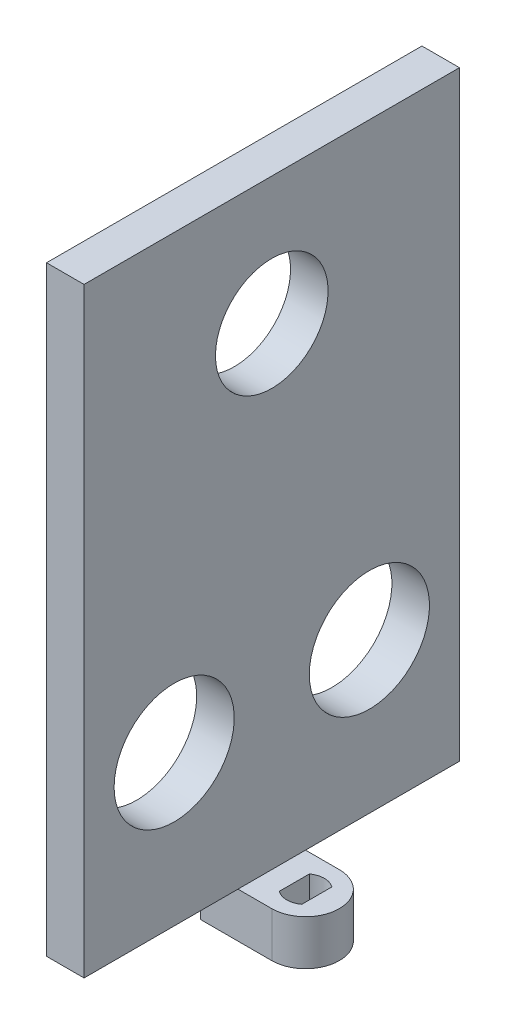
ISO-10303-21;
HEADER;
FILE_DESCRIPTION(('STEP AP214'),'2;1');
FILE_NAME('part.step','',(''),(''),'','','');
FILE_SCHEMA(('AUTOMOTIVE_DESIGN { 1 0 10303 214 1 1 1 1 }'));
ENDSEC;
DATA;
#1=APPLICATION_CONTEXT('core data for automotive mechanical design processes');
#2=APPLICATION_PROTOCOL_DEFINITION('international standard','automotive_design',2000,#1);
#3=PRODUCT_CONTEXT('',#1,'mechanical');
#4=PRODUCT('Part','Part','',(#3));
#5=PRODUCT_RELATED_PRODUCT_CATEGORY('part','',(#4));
#6=PRODUCT_DEFINITION_FORMATION('','',#4);
#7=PRODUCT_DEFINITION_CONTEXT('part definition',#1,'design');
#8=PRODUCT_DEFINITION('design','',#6,#7);
#9=PRODUCT_DEFINITION_SHAPE('','',#8);
#10=(LENGTH_UNIT() NAMED_UNIT(*) SI_UNIT(.MILLI.,.METRE.));
#11=(NAMED_UNIT(*) PLANE_ANGLE_UNIT() SI_UNIT($,.RADIAN.));
#12=(NAMED_UNIT(*) SI_UNIT($,.STERADIAN.) SOLID_ANGLE_UNIT());
#13=UNCERTAINTY_MEASURE_WITH_UNIT(LENGTH_MEASURE(1.E-05),#10,'distance_accuracy_value','');
#14=(GEOMETRIC_REPRESENTATION_CONTEXT(3) GLOBAL_UNCERTAINTY_ASSIGNED_CONTEXT((#13)) GLOBAL_UNIT_ASSIGNED_CONTEXT((#10,
#11,#12)) REPRESENTATION_CONTEXT('',''));
#15=CARTESIAN_POINT('',(0.,0.,0.));
#16=DIRECTION('',(0.,0.,1.));
#17=DIRECTION('',(1.,0.,0.));
#18=AXIS2_PLACEMENT_3D('',#15,#16,#17);
#19=CARTESIAN_POINT('',(0.,6.,4.5));
#20=DIRECTION('',(0.,0.,1.));
#21=DIRECTION('',(1.,0.,0.));
#22=AXIS2_PLACEMENT_3D('',#19,#20,#21);
#23=PLANE('',#22);
#24=DIRECTION('',(-1.,0.,0.));
#25=VECTOR('',#24,1.);
#26=CARTESIAN_POINT('',(0.,0.,4.5));
#27=LINE('',#26,#25);
#28=CARTESIAN_POINT('',(0.,0.,4.5));
#29=VERTEX_POINT('',#28);
#30=CARTESIAN_POINT('',(-9.5,0.,4.5));
#31=VERTEX_POINT('',#30);
#32=EDGE_CURVE('E267',#29,#31,#27,.T.);
#33=ORIENTED_EDGE('',*,*,#32,.F.);
#34=DIRECTION('',(0.,-1.,0.));
#35=VECTOR('',#34,1.);
#36=CARTESIAN_POINT('',(0.,6.,4.5));
#37=LINE('',#36,#35);
#38=CARTESIAN_POINT('',(0.,6.,4.5));
#39=VERTEX_POINT('',#38);
#40=EDGE_CURVE('E60',#39,#29,#37,.T.);
#41=ORIENTED_EDGE('',*,*,#40,.F.);
#42=DIRECTION('',(-1.,0.,0.));
#43=VECTOR('',#42,1.);
#44=CARTESIAN_POINT('',(0.,6.,4.5));
#45=LINE('',#44,#43);
#46=CARTESIAN_POINT('',(-4.5,6.,4.5));
#47=VERTEX_POINT('',#46);
#48=EDGE_CURVE('E151',#39,#47,#45,.T.);
#49=ORIENTED_EDGE('',*,*,#48,.T.);
#50=CARTESIAN_POINT('',(-9.5,6.,4.5));
#51=VERTEX_POINT('',#50);
#52=EDGE_CURVE('E76',#47,#51,#45,.T.);
#53=ORIENTED_EDGE('',*,*,#52,.T.);
#54=DIRECTION('',(0.,-1.,0.));
#55=VECTOR('',#54,1.);
#56=CARTESIAN_POINT('',(-9.5,6.,4.5));
#57=LINE('',#56,#55);
#58=EDGE_CURVE('E107',#51,#31,#57,.T.);
#59=ORIENTED_EDGE('',*,*,#58,.T.);
#60=EDGE_LOOP('',(#33,#41,#49,#53,#59));
#61=FACE_BOUND('',#60,.T.);
#62=ADVANCED_FACE('F50',(#61),#23,.T.);
#63=CARTESIAN_POINT('',(0.,6.,0.));
#64=DIRECTION('',(0.,-1.,0.));
#65=DIRECTION('',(0.,0.,-1.));
#66=AXIS2_PLACEMENT_3D('',#63,#64,#65);
#67=CYLINDRICAL_SURFACE('',#66,4.5);
#68=CARTESIAN_POINT('',(0.,0.,0.));
#69=DIRECTION('',(0.,1.,0.));
#70=DIRECTION('',(0.,0.,1.));
#71=AXIS2_PLACEMENT_3D('',#68,#69,#70);
#72=CIRCLE('',#71,4.5);
#73=CARTESIAN_POINT('',(0.,0.,-4.5));
#74=VERTEX_POINT('',#73);
#75=EDGE_CURVE('E157',#29,#74,#72,.T.);
#76=ORIENTED_EDGE('',*,*,#75,.T.);
#77=DIRECTION('',(0.,-1.,0.));
#78=VECTOR('',#77,1.);
#79=CARTESIAN_POINT('',(0.,6.,-4.5));
#80=LINE('',#79,#78);
#81=CARTESIAN_POINT('',(0.,6.,-4.5));
#82=VERTEX_POINT('',#81);
#83=EDGE_CURVE('E139',#82,#74,#80,.T.);
#84=ORIENTED_EDGE('',*,*,#83,.F.);
#85=CARTESIAN_POINT('',(0.,6.,0.));
#86=DIRECTION('',(0.,1.,0.));
#87=DIRECTION('',(0.,0.,1.));
#88=AXIS2_PLACEMENT_3D('',#85,#86,#87);
#89=CIRCLE('',#88,4.5);
#90=EDGE_CURVE('E148',#39,#82,#89,.T.);
#91=ORIENTED_EDGE('',*,*,#90,.F.);
#92=ORIENTED_EDGE('',*,*,#40,.T.);
#93=EDGE_LOOP('',(#76,#84,#91,#92));
#94=FACE_BOUND('',#93,.T.);
#95=ADVANCED_FACE('F155',(#94),#67,.T.);
#96=CARTESIAN_POINT('',(0.,6.,-4.5));
#97=DIRECTION('',(0.,0.,1.));
#98=DIRECTION('',(1.,0.,0.));
#99=AXIS2_PLACEMENT_3D('',#96,#97,#98);
#100=PLANE('',#99);
#101=DIRECTION('',(-1.,0.,0.));
#102=VECTOR('',#101,1.);
#103=CARTESIAN_POINT('',(0.,0.,-4.5));
#104=LINE('',#103,#102);
#105=CARTESIAN_POINT('',(-9.5,0.,-4.5));
#106=VERTEX_POINT('',#105);
#107=EDGE_CURVE('E273',#74,#106,#104,.T.);
#108=ORIENTED_EDGE('',*,*,#107,.T.);
#109=DIRECTION('',(0.,-1.,0.));
#110=VECTOR('',#109,1.);
#111=CARTESIAN_POINT('',(-9.5,6.,-4.5));
#112=LINE('',#111,#110);
#113=CARTESIAN_POINT('',(-9.5,6.,-4.5));
#114=VERTEX_POINT('',#113);
#115=EDGE_CURVE('E159',#114,#106,#112,.T.);
#116=ORIENTED_EDGE('',*,*,#115,.F.);
#117=DIRECTION('',(-1.,0.,0.));
#118=VECTOR('',#117,1.);
#119=CARTESIAN_POINT('',(0.,6.,-4.5));
#120=LINE('',#119,#118);
#121=CARTESIAN_POINT('',(-4.5,6.,-4.5));
#122=VERTEX_POINT('',#121);
#123=EDGE_CURVE('E142',#122,#114,#120,.T.);
#124=ORIENTED_EDGE('',*,*,#123,.F.);
#125=EDGE_CURVE('E134',#82,#122,#120,.T.);
#126=ORIENTED_EDGE('',*,*,#125,.F.);
#127=ORIENTED_EDGE('',*,*,#83,.T.);
#128=EDGE_LOOP('',(#108,#116,#124,#126,#127));
#129=FACE_BOUND('',#128,.T.);
#130=ADVANCED_FACE('F137',(#129),#100,.F.);
#131=CARTESIAN_POINT('',(1.5,6.,0.));
#132=DIRECTION('',(-1.,0.,0.));
#133=DIRECTION('',(0.,0.,1.));
#134=AXIS2_PLACEMENT_3D('',#131,#132,#133);
#135=PLANE('',#134);
#136=DIRECTION('',(0.,0.,-1.));
#137=VECTOR('',#136,1.);
#138=CARTESIAN_POINT('',(1.5,0.,0.));
#139=LINE('',#138,#137);
#140=CARTESIAN_POINT('',(1.5,0.,2.));
#141=VERTEX_POINT('',#140);
#142=CARTESIAN_POINT('',(1.5,0.,-2.));
#143=VERTEX_POINT('',#142);
#144=EDGE_CURVE('E234',#141,#143,#139,.T.);
#145=ORIENTED_EDGE('',*,*,#144,.F.);
#146=DIRECTION('',(0.,-1.,0.));
#147=VECTOR('',#146,1.);
#148=CARTESIAN_POINT('',(1.5,6.,2.));
#149=LINE('',#148,#147);
#150=CARTESIAN_POINT('',(1.5,6.,2.));
#151=VERTEX_POINT('',#150);
#152=EDGE_CURVE('E115',#151,#141,#149,.T.);
#153=ORIENTED_EDGE('',*,*,#152,.F.);
#154=DIRECTION('',(0.,0.,-1.));
#155=VECTOR('',#154,1.);
#156=CARTESIAN_POINT('',(1.5,6.,0.));
#157=LINE('',#156,#155);
#158=CARTESIAN_POINT('',(1.5,6.,-2.));
#159=VERTEX_POINT('',#158);
#160=EDGE_CURVE('E235',#151,#159,#157,.T.);
#161=ORIENTED_EDGE('',*,*,#160,.T.);
#162=DIRECTION('',(0.,-1.,0.));
#163=VECTOR('',#162,1.);
#164=CARTESIAN_POINT('',(1.5,6.,-2.));
#165=LINE('',#164,#163);
#166=EDGE_CURVE('E145',#159,#143,#165,.T.);
#167=ORIENTED_EDGE('',*,*,#166,.T.);
#168=EDGE_LOOP('',(#145,#153,#161,#167));
#169=FACE_BOUND('',#168,.T.);
#170=ADVANCED_FACE('F52',(#169),#135,.T.);
#171=CARTESIAN_POINT('',(0.,6.,0.));
#172=DIRECTION('',(0.,-1.,0.));
#173=DIRECTION('',(0.,0.,-1.));
#174=AXIS2_PLACEMENT_3D('',#171,#172,#173);
#175=CYLINDRICAL_SURFACE('',#174,2.5);
#176=CARTESIAN_POINT('',(0.,0.,0.));
#177=DIRECTION('',(0.,1.,0.));
#178=DIRECTION('',(0.,0.,1.));
#179=AXIS2_PLACEMENT_3D('',#176,#177,#178);
#180=CIRCLE('',#179,2.5);
#181=CARTESIAN_POINT('',(-1.5,0.,2.));
#182=VERTEX_POINT('',#181);
#183=EDGE_CURVE('E255',#182,#141,#180,.T.);
#184=ORIENTED_EDGE('',*,*,#183,.F.);
#185=DIRECTION('',(0.,-1.,0.));
#186=VECTOR('',#185,1.);
#187=CARTESIAN_POINT('',(-1.5,6.,2.));
#188=LINE('',#187,#186);
#189=CARTESIAN_POINT('',(-1.5,6.,2.));
#190=VERTEX_POINT('',#189);
#191=EDGE_CURVE('E173',#190,#182,#188,.T.);
#192=ORIENTED_EDGE('',*,*,#191,.F.);
#193=CARTESIAN_POINT('',(0.,6.,0.));
#194=DIRECTION('',(0.,1.,0.));
#195=DIRECTION('',(0.,0.,1.));
#196=AXIS2_PLACEMENT_3D('',#193,#194,#195);
#197=CIRCLE('',#196,2.5);
#198=EDGE_CURVE('E238',#190,#151,#197,.T.);
#199=ORIENTED_EDGE('',*,*,#198,.T.);
#200=ORIENTED_EDGE('',*,*,#152,.T.);
#201=EDGE_LOOP('',(#184,#192,#199,#200));
#202=FACE_BOUND('',#201,.T.);
#203=ADVANCED_FACE('F358',(#202),#175,.F.);
#204=CARTESIAN_POINT('',(-1.5,6.,0.));
#205=DIRECTION('',(-1.,0.,0.));
#206=DIRECTION('',(0.,0.,1.));
#207=AXIS2_PLACEMENT_3D('',#204,#205,#206);
#208=PLANE('',#207);
#209=DIRECTION('',(0.,0.,-1.));
#210=VECTOR('',#209,1.);
#211=CARTESIAN_POINT('',(-1.5,0.,0.));
#212=LINE('',#211,#210);
#213=CARTESIAN_POINT('',(-1.5,0.,-2.));
#214=VERTEX_POINT('',#213);
#215=EDGE_CURVE('E259',#182,#214,#212,.T.);
#216=ORIENTED_EDGE('',*,*,#215,.T.);
#217=DIRECTION('',(0.,-1.,0.));
#218=VECTOR('',#217,1.);
#219=CARTESIAN_POINT('',(-1.5,6.,-2.));
#220=LINE('',#219,#218);
#221=CARTESIAN_POINT('',(-1.5,6.,-2.));
#222=VERTEX_POINT('',#221);
#223=EDGE_CURVE('E170',#222,#214,#220,.T.);
#224=ORIENTED_EDGE('',*,*,#223,.F.);
#225=DIRECTION('',(0.,0.,-1.));
#226=VECTOR('',#225,1.);
#227=CARTESIAN_POINT('',(-1.5,6.,0.));
#228=LINE('',#227,#226);
#229=EDGE_CURVE('E243',#190,#222,#228,.T.);
#230=ORIENTED_EDGE('',*,*,#229,.F.);
#231=ORIENTED_EDGE('',*,*,#191,.T.);
#232=EDGE_LOOP('',(#216,#224,#230,#231));
#233=FACE_BOUND('',#232,.T.);
#234=ADVANCED_FACE('F355',(#233),#208,.F.);
#235=CARTESIAN_POINT('',(0.,6.,0.));
#236=DIRECTION('',(0.,-1.,0.));
#237=DIRECTION('',(0.,0.,-1.));
#238=AXIS2_PLACEMENT_3D('',#235,#236,#237);
#239=CYLINDRICAL_SURFACE('',#238,2.5);
#240=CARTESIAN_POINT('',(0.,0.,0.));
#241=DIRECTION('',(0.,1.,0.));
#242=DIRECTION('',(0.,0.,1.));
#243=AXIS2_PLACEMENT_3D('',#240,#241,#242);
#244=CIRCLE('',#243,2.5);
#245=EDGE_CURVE('E263',#143,#214,#244,.T.);
#246=ORIENTED_EDGE('',*,*,#245,.F.);
#247=ORIENTED_EDGE('',*,*,#166,.F.);
#248=CARTESIAN_POINT('',(0.,6.,0.));
#249=DIRECTION('',(0.,1.,0.));
#250=DIRECTION('',(0.,0.,1.));
#251=AXIS2_PLACEMENT_3D('',#248,#249,#250);
#252=CIRCLE('',#251,2.5);
#253=EDGE_CURVE('E246',#159,#222,#252,.T.);
#254=ORIENTED_EDGE('',*,*,#253,.T.);
#255=ORIENTED_EDGE('',*,*,#223,.T.);
#256=EDGE_LOOP('',(#246,#247,#254,#255));
#257=FACE_BOUND('',#256,.T.);
#258=ADVANCED_FACE('F352',(#257),#239,.F.);
#259=CARTESIAN_POINT('',(-9.5,6.,0.));
#260=DIRECTION('',(1.,0.,0.));
#261=DIRECTION('',(0.,0.,-1.));
#262=AXIS2_PLACEMENT_3D('',#259,#260,#261);
#263=PLANE('',#262);
#264=CARTESIAN_POINT('',(-9.5,69.,0.));
#265=DIRECTION('',(-1.,0.,0.));
#266=DIRECTION('',(0.,0.,1.));
#267=AXIS2_PLACEMENT_3D('',#264,#265,#266);
#268=CIRCLE('',#267,7.50000000000001);
#269=CARTESIAN_POINT('',(-9.5,69.,7.50000000000001));
#270=VERTEX_POINT('',#269);
#271=EDGE_CURVE('E182',#270,#270,#268,.T.);
#272=ORIENTED_EDGE('',*,*,#271,.F.);
#273=EDGE_LOOP('',(#272));
#274=FACE_BOUND('',#273,.T.);
#275=CARTESIAN_POINT('',(-9.5,26.,-13.));
#276=DIRECTION('',(-1.,0.,0.));
#277=DIRECTION('',(0.,0.,1.));
#278=AXIS2_PLACEMENT_3D('',#275,#276,#277);
#279=CIRCLE('',#278,8.);
#280=CARTESIAN_POINT('',(-9.5,26.,-5.));
#281=VERTEX_POINT('',#280);
#282=EDGE_CURVE('E512',#281,#281,#279,.T.);
#283=ORIENTED_EDGE('',*,*,#282,.F.);
#284=EDGE_LOOP('',(#283));
#285=FACE_BOUND('',#284,.T.);
#286=CARTESIAN_POINT('',(-9.5,26.,13.));
#287=DIRECTION('',(-1.,0.,0.));
#288=DIRECTION('',(0.,0.,1.));
#289=AXIS2_PLACEMENT_3D('',#286,#287,#288);
#290=CIRCLE('',#289,8.);
#291=CARTESIAN_POINT('',(-9.5,26.,21.));
#292=VERTEX_POINT('',#291);
#293=EDGE_CURVE('E516',#292,#292,#290,.T.);
#294=ORIENTED_EDGE('',*,*,#293,.F.);
#295=EDGE_LOOP('',(#294));
#296=FACE_BOUND('',#295,.T.);
#297=DIRECTION('',(0.,0.,1.));
#298=VECTOR('',#297,1.);
#299=CARTESIAN_POINT('',(-9.5,0.,0.));
#300=LINE('',#299,#298);
#301=EDGE_CURVE('E239',#106,#31,#300,.T.);
#302=ORIENTED_EDGE('',*,*,#301,.T.);
#303=ORIENTED_EDGE('',*,*,#58,.F.);
#304=DIRECTION('',(0.,0.,1.));
#305=VECTOR('',#304,1.);
#306=CARTESIAN_POINT('',(-9.5,6.,25.));
#307=LINE('',#306,#305);
#308=CARTESIAN_POINT('',(-9.5,6.,25.));
#309=VERTEX_POINT('',#308);
#310=EDGE_CURVE('E189',#51,#309,#307,.T.);
#311=ORIENTED_EDGE('',*,*,#310,.T.);
#312=DIRECTION('',(0.,-1.,0.));
#313=VECTOR('',#312,1.);
#314=CARTESIAN_POINT('',(-9.5,86.,25.));
#315=LINE('',#314,#313);
#316=CARTESIAN_POINT('',(-9.5,86.,25.));
#317=VERTEX_POINT('',#316);
#318=EDGE_CURVE('E230',#317,#309,#315,.T.);
#319=ORIENTED_EDGE('',*,*,#318,.F.);
#320=DIRECTION('',(0.,0.,1.));
#321=VECTOR('',#320,1.);
#322=CARTESIAN_POINT('',(-9.5,86.,25.));
#323=LINE('',#322,#321);
#324=CARTESIAN_POINT('',(-9.5,86.,-25.));
#325=VERTEX_POINT('',#324);
#326=EDGE_CURVE('E217',#325,#317,#323,.T.);
#327=ORIENTED_EDGE('',*,*,#326,.F.);
#328=DIRECTION('',(0.,-1.,0.));
#329=VECTOR('',#328,1.);
#330=CARTESIAN_POINT('',(-9.5,86.,-25.));
#331=LINE('',#330,#329);
#332=CARTESIAN_POINT('',(-9.5,6.,-25.));
#333=VERTEX_POINT('',#332);
#334=EDGE_CURVE('E218',#325,#333,#331,.T.);
#335=ORIENTED_EDGE('',*,*,#334,.T.);
#336=EDGE_CURVE('E194',#333,#114,#307,.T.);
#337=ORIENTED_EDGE('',*,*,#336,.T.);
#338=ORIENTED_EDGE('',*,*,#115,.T.);
#339=EDGE_LOOP('',(#302,#303,#311,#319,#327,#335,#337,#338));
#340=FACE_BOUND('',#339,.T.);
#341=ADVANCED_FACE('F312',(#274,#285,#296,#340),#263,.F.);
#342=CARTESIAN_POINT('',(0.,6.,0.));
#343=DIRECTION('',(0.,1.,0.));
#344=DIRECTION('',(0.,0.,1.));
#345=AXIS2_PLACEMENT_3D('',#342,#343,#344);
#346=PLANE('',#345);
#347=DIRECTION('',(0.,0.,-1.));
#348=VECTOR('',#347,1.);
#349=CARTESIAN_POINT('',(-4.5,6.,25.));
#350=LINE('',#349,#348);
#351=EDGE_CURVE('E12',#47,#122,#350,.T.);
#352=ORIENTED_EDGE('',*,*,#351,.F.);
#353=ORIENTED_EDGE('',*,*,#48,.F.);
#354=ORIENTED_EDGE('',*,*,#90,.T.);
#355=ORIENTED_EDGE('',*,*,#125,.T.);
#356=EDGE_LOOP('',(#352,#353,#354,#355));
#357=FACE_BOUND('',#356,.T.);
#358=ORIENTED_EDGE('',*,*,#160,.F.);
#359=ORIENTED_EDGE('',*,*,#198,.F.);
#360=ORIENTED_EDGE('',*,*,#229,.T.);
#361=ORIENTED_EDGE('',*,*,#253,.F.);
#362=EDGE_LOOP('',(#358,#359,#360,#361));
#363=FACE_BOUND('',#362,.T.);
#364=ADVANCED_FACE('F149',(#357,#363),#346,.T.);
#365=CARTESIAN_POINT('',(0.,0.,0.));
#366=DIRECTION('',(0.,1.,0.));
#367=DIRECTION('',(0.,0.,1.));
#368=AXIS2_PLACEMENT_3D('',#365,#366,#367);
#369=PLANE('',#368);
#370=ORIENTED_EDGE('',*,*,#144,.T.);
#371=ORIENTED_EDGE('',*,*,#245,.T.);
#372=ORIENTED_EDGE('',*,*,#215,.F.);
#373=ORIENTED_EDGE('',*,*,#183,.T.);
#374=EDGE_LOOP('',(#370,#371,#372,#373));
#375=FACE_BOUND('',#374,.T.);
#376=ORIENTED_EDGE('',*,*,#32,.T.);
#377=ORIENTED_EDGE('',*,*,#301,.F.);
#378=ORIENTED_EDGE('',*,*,#107,.F.);
#379=ORIENTED_EDGE('',*,*,#75,.F.);
#380=EDGE_LOOP('',(#376,#377,#378,#379));
#381=FACE_BOUND('',#380,.T.);
#382=ADVANCED_FACE('F330',(#375,#381),#369,.F.);
#383=CARTESIAN_POINT('',(0.,6.,0.));
#384=DIRECTION('',(0.,-1.,0.));
#385=DIRECTION('',(0.,0.,-1.));
#386=AXIS2_PLACEMENT_3D('',#383,#384,#385);
#387=PLANE('',#386);
#388=ORIENTED_EDGE('',*,*,#52,.F.);
#389=CARTESIAN_POINT('',(-4.5,6.,25.));
#390=VERTEX_POINT('',#389);
#391=EDGE_CURVE('E62',#390,#47,#350,.T.);
#392=ORIENTED_EDGE('',*,*,#391,.F.);
#393=DIRECTION('',(1.,0.,0.));
#394=VECTOR('',#393,1.);
#395=CARTESIAN_POINT('',(-9.5,6.,25.));
#396=LINE('',#395,#394);
#397=EDGE_CURVE('E203',#309,#390,#396,.T.);
#398=ORIENTED_EDGE('',*,*,#397,.F.);
#399=ORIENTED_EDGE('',*,*,#310,.F.);
#400=EDGE_LOOP('',(#388,#392,#398,#399));
#401=FACE_BOUND('',#400,.T.);
#402=ADVANCED_FACE('F328',(#401),#387,.T.);
#403=CARTESIAN_POINT('',(-9.5,86.,25.));
#404=DIRECTION('',(0.,0.,-1.));
#405=DIRECTION('',(-1.,0.,0.));
#406=AXIS2_PLACEMENT_3D('',#403,#404,#405);
#407=PLANE('',#406);
#408=ORIENTED_EDGE('',*,*,#397,.T.);
#409=DIRECTION('',(0.,-1.,0.));
#410=VECTOR('',#409,1.);
#411=CARTESIAN_POINT('',(-4.5,86.,25.));
#412=LINE('',#411,#410);
#413=CARTESIAN_POINT('',(-4.5,86.,25.));
#414=VERTEX_POINT('',#413);
#415=EDGE_CURVE('E226',#414,#390,#412,.T.);
#416=ORIENTED_EDGE('',*,*,#415,.F.);
#417=DIRECTION('',(1.,0.,0.));
#418=VECTOR('',#417,1.);
#419=CARTESIAN_POINT('',(-9.5,86.,25.));
#420=LINE('',#419,#418);
#421=EDGE_CURVE('E286',#317,#414,#420,.T.);
#422=ORIENTED_EDGE('',*,*,#421,.F.);
#423=ORIENTED_EDGE('',*,*,#318,.T.);
#424=EDGE_LOOP('',(#408,#416,#422,#423));
#425=FACE_BOUND('',#424,.T.);
#426=ADVANCED_FACE('F324',(#425),#407,.F.);
#427=CARTESIAN_POINT('',(-4.5,86.,25.));
#428=DIRECTION('',(-1.,0.,0.));
#429=DIRECTION('',(0.,0.,1.));
#430=AXIS2_PLACEMENT_3D('',#427,#428,#429);
#431=PLANE('',#430);
#432=CARTESIAN_POINT('',(-4.5,69.,0.));
#433=DIRECTION('',(-1.,0.,0.));
#434=DIRECTION('',(0.,0.,1.));
#435=AXIS2_PLACEMENT_3D('',#432,#433,#434);
#436=CIRCLE('',#435,7.50000000000001);
#437=CARTESIAN_POINT('',(-4.5,69.,7.50000000000001));
#438=VERTEX_POINT('',#437);
#439=EDGE_CURVE('E54',#438,#438,#436,.T.);
#440=ORIENTED_EDGE('',*,*,#439,.T.);
#441=EDGE_LOOP('',(#440));
#442=FACE_BOUND('',#441,.T.);
#443=CARTESIAN_POINT('',(-4.5,26.,-13.));
#444=DIRECTION('',(-1.,0.,0.));
#445=DIRECTION('',(0.,0.,1.));
#446=AXIS2_PLACEMENT_3D('',#443,#444,#445);
#447=CIRCLE('',#446,8.);
#448=CARTESIAN_POINT('',(-4.5,26.,-5.));
#449=VERTEX_POINT('',#448);
#450=EDGE_CURVE('E181',#449,#449,#447,.T.);
#451=ORIENTED_EDGE('',*,*,#450,.T.);
#452=EDGE_LOOP('',(#451));
#453=FACE_BOUND('',#452,.T.);
#454=CARTESIAN_POINT('',(-4.5,26.,13.));
#455=DIRECTION('',(-1.,0.,0.));
#456=DIRECTION('',(0.,0.,1.));
#457=AXIS2_PLACEMENT_3D('',#454,#455,#456);
#458=CIRCLE('',#457,8.);
#459=CARTESIAN_POINT('',(-4.5,26.,21.));
#460=VERTEX_POINT('',#459);
#461=EDGE_CURVE('E178',#460,#460,#458,.T.);
#462=ORIENTED_EDGE('',*,*,#461,.T.);
#463=EDGE_LOOP('',(#462));
#464=FACE_BOUND('',#463,.T.);
#465=ORIENTED_EDGE('',*,*,#391,.T.);
#466=ORIENTED_EDGE('',*,*,#351,.T.);
#467=CARTESIAN_POINT('',(-4.5,6.,-25.));
#468=VERTEX_POINT('',#467);
#469=EDGE_CURVE('E63',#122,#468,#350,.T.);
#470=ORIENTED_EDGE('',*,*,#469,.T.);
#471=DIRECTION('',(0.,-1.,0.));
#472=VECTOR('',#471,1.);
#473=CARTESIAN_POINT('',(-4.5,86.,-25.));
#474=LINE('',#473,#472);
#475=CARTESIAN_POINT('',(-4.5,86.,-25.));
#476=VERTEX_POINT('',#475);
#477=EDGE_CURVE('E222',#476,#468,#474,.T.);
#478=ORIENTED_EDGE('',*,*,#477,.F.);
#479=DIRECTION('',(0.,0.,-1.));
#480=VECTOR('',#479,1.);
#481=CARTESIAN_POINT('',(-4.5,86.,25.));
#482=LINE('',#481,#480);
#483=EDGE_CURVE('E283',#414,#476,#482,.T.);
#484=ORIENTED_EDGE('',*,*,#483,.F.);
#485=ORIENTED_EDGE('',*,*,#415,.T.);
#486=EDGE_LOOP('',(#465,#466,#470,#478,#484,#485));
#487=FACE_BOUND('',#486,.T.);
#488=ADVANCED_FACE('F297',(#442,#453,#464,#487),#431,.F.);
#489=CARTESIAN_POINT('',(-9.5,86.,-25.));
#490=DIRECTION('',(0.,0.,1.));
#491=DIRECTION('',(1.,0.,0.));
#492=AXIS2_PLACEMENT_3D('',#489,#490,#491);
#493=PLANE('',#492);
#494=DIRECTION('',(-1.,0.,0.));
#495=VECTOR('',#494,1.);
#496=CARTESIAN_POINT('',(-9.5,6.,-25.));
#497=LINE('',#496,#495);
#498=EDGE_CURVE('E213',#468,#333,#497,.T.);
#499=ORIENTED_EDGE('',*,*,#498,.T.);
#500=ORIENTED_EDGE('',*,*,#334,.F.);
#501=DIRECTION('',(-1.,0.,0.));
#502=VECTOR('',#501,1.);
#503=CARTESIAN_POINT('',(-9.5,86.,-25.));
#504=LINE('',#503,#502);
#505=EDGE_CURVE('E206',#476,#325,#504,.T.);
#506=ORIENTED_EDGE('',*,*,#505,.F.);
#507=ORIENTED_EDGE('',*,*,#477,.T.);
#508=EDGE_LOOP('',(#499,#500,#506,#507));
#509=FACE_BOUND('',#508,.T.);
#510=ADVANCED_FACE('F307',(#509),#493,.F.);
#511=CARTESIAN_POINT('',(0.,86.,0.));
#512=DIRECTION('',(0.,-1.,0.));
#513=DIRECTION('',(0.,0.,-1.));
#514=AXIS2_PLACEMENT_3D('',#511,#512,#513);
#515=PLANE('',#514);
#516=ORIENTED_EDGE('',*,*,#326,.T.);
#517=ORIENTED_EDGE('',*,*,#421,.T.);
#518=ORIENTED_EDGE('',*,*,#483,.T.);
#519=ORIENTED_EDGE('',*,*,#505,.T.);
#520=EDGE_LOOP('',(#516,#517,#518,#519));
#521=FACE_BOUND('',#520,.T.);
#522=ADVANCED_FACE('F343',(#521),#515,.F.);
#523=ORIENTED_EDGE('',*,*,#469,.F.);
#524=ORIENTED_EDGE('',*,*,#123,.T.);
#525=ORIENTED_EDGE('',*,*,#336,.F.);
#526=ORIENTED_EDGE('',*,*,#498,.F.);
#527=EDGE_LOOP('',(#523,#524,#525,#526));
#528=FACE_BOUND('',#527,.T.);
#529=ADVANCED_FACE('F310',(#528),#387,.T.);
#530=CARTESIAN_POINT('',(70.5,26.,13.));
#531=DIRECTION('',(-1.,0.,0.));
#532=DIRECTION('',(0.,0.,1.));
#533=AXIS2_PLACEMENT_3D('',#530,#531,#532);
#534=CYLINDRICAL_SURFACE('',#533,8.);
#535=ORIENTED_EDGE('',*,*,#293,.T.);
#536=EDGE_LOOP('',(#535));
#537=FACE_BOUND('',#536,.T.);
#538=ORIENTED_EDGE('',*,*,#461,.F.);
#539=EDGE_LOOP('',(#538));
#540=FACE_BOUND('',#539,.T.);
#541=ADVANCED_FACE('F342',(#537,#540),#534,.F.);
#542=CARTESIAN_POINT('',(70.5,26.,-13.));
#543=DIRECTION('',(-1.,0.,0.));
#544=DIRECTION('',(0.,0.,1.));
#545=AXIS2_PLACEMENT_3D('',#542,#543,#544);
#546=CYLINDRICAL_SURFACE('',#545,8.);
#547=ORIENTED_EDGE('',*,*,#282,.T.);
#548=EDGE_LOOP('',(#547));
#549=FACE_BOUND('',#548,.T.);
#550=ORIENTED_EDGE('',*,*,#450,.F.);
#551=EDGE_LOOP('',(#550));
#552=FACE_BOUND('',#551,.T.);
#553=ADVANCED_FACE('F477',(#549,#552),#546,.F.);
#554=CARTESIAN_POINT('',(70.5,69.,0.));
#555=DIRECTION('',(-1.,0.,0.));
#556=DIRECTION('',(0.,0.,1.));
#557=AXIS2_PLACEMENT_3D('',#554,#555,#556);
#558=CYLINDRICAL_SURFACE('',#557,7.50000000000001);
#559=ORIENTED_EDGE('',*,*,#271,.T.);
#560=EDGE_LOOP('',(#559));
#561=FACE_BOUND('',#560,.T.);
#562=ORIENTED_EDGE('',*,*,#439,.F.);
#563=EDGE_LOOP('',(#562));
#564=FACE_BOUND('',#563,.T.);
#565=ADVANCED_FACE('F489',(#561,#564),#558,.F.);
#566=CLOSED_SHELL('',(#62,#95,#130,#170,#203,#234,#258,#341,#364,#382,#402,#426,#488,#510,#522,
#529,#541,#553,#565));
#567=MANIFOLD_SOLID_BREP('B2',#566);
#568=ADVANCED_BREP_SHAPE_REPRESENTATION('',(#18,#567),#14);
#569=SHAPE_DEFINITION_REPRESENTATION(#9,#568);
ENDSEC;
END-ISO-10303-21;
